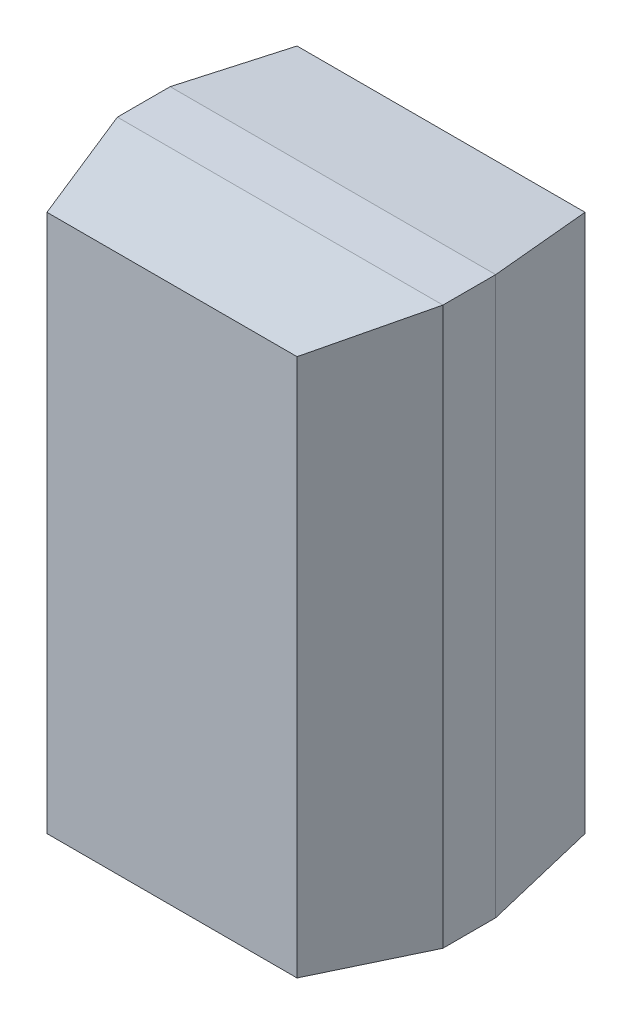
ISO-10303-21;
HEADER;
FILE_DESCRIPTION(('STEP AP214'),'2;1');
FILE_NAME('part.step','',(''),(''),'','','');
FILE_SCHEMA(('AUTOMOTIVE_DESIGN { 1 0 10303 214 1 1 1 1 }'));
ENDSEC;
DATA;
#1=APPLICATION_CONTEXT('core data for automotive mechanical design processes');
#2=APPLICATION_PROTOCOL_DEFINITION('international standard','automotive_design',2000,#1);
#3=PRODUCT_CONTEXT('',#1,'mechanical');
#4=PRODUCT('Part','Part','',(#3));
#5=PRODUCT_RELATED_PRODUCT_CATEGORY('part','',(#4));
#6=PRODUCT_DEFINITION_FORMATION('','',#4);
#7=PRODUCT_DEFINITION_CONTEXT('part definition',#1,'design');
#8=PRODUCT_DEFINITION('design','',#6,#7);
#9=PRODUCT_DEFINITION_SHAPE('','',#8);
#10=(LENGTH_UNIT() NAMED_UNIT(*) SI_UNIT(.MILLI.,.METRE.));
#11=(NAMED_UNIT(*) PLANE_ANGLE_UNIT() SI_UNIT($,.RADIAN.));
#12=(NAMED_UNIT(*) SI_UNIT($,.STERADIAN.) SOLID_ANGLE_UNIT());
#13=UNCERTAINTY_MEASURE_WITH_UNIT(LENGTH_MEASURE(1.E-05),#10,'distance_accuracy_value','');
#14=(GEOMETRIC_REPRESENTATION_CONTEXT(3) GLOBAL_UNCERTAINTY_ASSIGNED_CONTEXT((#13)) GLOBAL_UNIT_ASSIGNED_CONTEXT((#10,
#11,#12)) REPRESENTATION_CONTEXT('',''));
#15=CARTESIAN_POINT('',(0.,0.,0.));
#16=DIRECTION('',(0.,0.,1.));
#17=DIRECTION('',(1.,0.,0.));
#18=AXIS2_PLACEMENT_3D('',#15,#16,#17);
#19=CARTESIAN_POINT('',(-0.673,-1.448,1.448));
#20=DIRECTION('',(0.,0.,1.));
#21=DIRECTION('',(0.,1.,0.));
#22=AXIS2_PLACEMENT_3D('',#19,#20,#21);
#23=PLANE('',#22);
#24=CARTESIAN_POINT('',(0.673000000000001,-1.44816141898888,1.44801409985144));
#25=DIRECTION('',(-1.,0.,0.));
#26=VECTOR('',#25,1.);
#27=LINE('',#24,#26);
#28=CARTESIAN_POINT('',(0.673,-1.448,1.448));
#29=VERTEX_POINT('',#28);
#30=CARTESIAN_POINT('',(-0.673,-1.448,1.448));
#31=VERTEX_POINT('',#30);
#32=EDGE_CURVE('E11',#29,#31,#27,.T.);
#33=ORIENTED_EDGE('',*,*,#32,.F.);
#34=CARTESIAN_POINT('',(0.672595982544628,1.448,1.44785876508446));
#35=DIRECTION('',(0.,-1.,0.));
#36=VECTOR('',#35,1.);
#37=LINE('',#34,#36);
#38=CARTESIAN_POINT('',(0.673,1.448,1.448));
#39=VERTEX_POINT('',#38);
#40=EDGE_CURVE('E25',#39,#29,#37,.T.);
#41=ORIENTED_EDGE('',*,*,#40,.F.);
#42=CARTESIAN_POINT('',(-0.673000000000001,1.44816141898888,1.44801409985144));
#43=DIRECTION('',(1.,0.,0.));
#44=VECTOR('',#43,1.);
#45=LINE('',#42,#44);
#46=CARTESIAN_POINT('',(-0.673,1.448,1.448));
#47=VERTEX_POINT('',#46);
#48=EDGE_CURVE('E297',#47,#39,#45,.T.);
#49=ORIENTED_EDGE('',*,*,#48,.F.);
#50=CARTESIAN_POINT('',(-0.672595982544628,-1.448,1.44785876508446));
#51=DIRECTION('',(0.,1.,0.));
#52=VECTOR('',#51,1.);
#53=LINE('',#50,#52);
#54=EDGE_CURVE('E320',#31,#47,#53,.T.);
#55=ORIENTED_EDGE('',*,*,#54,.F.);
#56=EDGE_LOOP('',(#33,#41,#49,#55));
#57=FACE_BOUND('',#56,.T.);
#58=ADVANCED_FACE('F17',(#57),#23,.T.);
#59=CARTESIAN_POINT('',(-0.876,-1.499,0.866));
#60=DIRECTION('',(0.,-0.996206734348292,0.0870180581207845));
#61=DIRECTION('',(0.,0.0870180581207845,0.996206734348292));
#62=AXIS2_PLACEMENT_3D('',#59,#60,#61);
#63=PLANE('',#62);
#64=DIRECTION('',(-1.,0.,0.));
#65=VECTOR('',#64,1.);
#66=CARTESIAN_POINT('',(0.876,-1.499,0.866));
#67=LINE('',#66,#65);
#68=CARTESIAN_POINT('',(0.876,-1.499,0.866));
#69=VERTEX_POINT('',#68);
#70=CARTESIAN_POINT('',(-0.876,-1.499,0.866));
#71=VERTEX_POINT('',#70);
#72=EDGE_CURVE('E333',#69,#71,#67,.T.);
#73=ORIENTED_EDGE('',*,*,#72,.F.);
#74=CARTESIAN_POINT('',(0.672595982544628,-1.448,1.44785876508446));
#75=DIRECTION('',(0.328883245123108,-0.0819817202010894,-0.940805404230951));
#76=VECTOR('',#75,1.);
#77=LINE('',#74,#76);
#78=EDGE_CURVE('E340',#29,#69,#77,.T.);
#79=ORIENTED_EDGE('',*,*,#78,.F.);
#80=ORIENTED_EDGE('',*,*,#32,.T.);
#81=CARTESIAN_POINT('',(-0.876,-1.499,0.866));
#82=DIRECTION('',(0.328883245123108,0.0819817202010884,0.940805404230951));
#83=VECTOR('',#82,1.);
#84=LINE('',#81,#83);
#85=EDGE_CURVE('E241',#71,#31,#84,.T.);
#86=ORIENTED_EDGE('',*,*,#85,.F.);
#87=EDGE_LOOP('',(#73,#79,#80,#86));
#88=FACE_BOUND('',#87,.T.);
#89=ADVANCED_FACE('F246',(#88),#63,.T.);
#90=CARTESIAN_POINT('',(0.876,-1.499,0.866));
#91=DIRECTION('',(0.94398300845877,0.,0.329994060160375));
#92=DIRECTION('',(-0.329994060160375,0.,0.94398300845877));
#93=AXIS2_PLACEMENT_3D('',#90,#91,#92);
#94=PLANE('',#93);
#95=DIRECTION('',(0.,-1.,0.));
#96=VECTOR('',#95,1.);
#97=CARTESIAN_POINT('',(0.876,1.499,0.866));
#98=LINE('',#97,#96);
#99=CARTESIAN_POINT('',(0.876,1.499,0.866));
#100=VERTEX_POINT('',#99);
#101=EDGE_CURVE('E238',#100,#69,#98,.T.);
#102=ORIENTED_EDGE('',*,*,#101,.F.);
#103=CARTESIAN_POINT('',(0.673,1.44816141898888,1.44801409985144));
#104=DIRECTION('',(0.32892666378567,0.0821759789969272,-0.940773276792409));
#105=VECTOR('',#104,1.);
#106=LINE('',#103,#105);
#107=EDGE_CURVE('E234',#39,#100,#106,.T.);
#108=ORIENTED_EDGE('',*,*,#107,.F.);
#109=ORIENTED_EDGE('',*,*,#40,.T.);
#110=ORIENTED_EDGE('',*,*,#78,.T.);
#111=EDGE_LOOP('',(#102,#108,#109,#110));
#112=FACE_BOUND('',#111,.T.);
#113=ADVANCED_FACE('F211',(#112),#94,.T.);
#114=CARTESIAN_POINT('',(0.876,1.499,0.866));
#115=DIRECTION('',(0.,0.996206734348292,0.0870180581207845));
#116=DIRECTION('',(0.,-0.0870180581207845,0.996206734348292));
#117=AXIS2_PLACEMENT_3D('',#114,#115,#116);
#118=PLANE('',#117);
#119=DIRECTION('',(1.,0.,0.));
#120=VECTOR('',#119,1.);
#121=CARTESIAN_POINT('',(-0.876,1.499,0.866));
#122=LINE('',#121,#120);
#123=CARTESIAN_POINT('',(-0.876,1.499,0.866));
#124=VERTEX_POINT('',#123);
#125=EDGE_CURVE('E472',#124,#100,#122,.T.);
#126=ORIENTED_EDGE('',*,*,#125,.F.);
#127=CARTESIAN_POINT('',(-0.672595982544628,1.448,1.44785876508446));
#128=DIRECTION('',(-0.328883245123108,0.0819817202010894,-0.940805404230951));
#129=VECTOR('',#128,1.);
#130=LINE('',#127,#129);
#131=EDGE_CURVE('E193',#47,#124,#130,.T.);
#132=ORIENTED_EDGE('',*,*,#131,.F.);
#133=ORIENTED_EDGE('',*,*,#48,.T.);
#134=ORIENTED_EDGE('',*,*,#107,.T.);
#135=EDGE_LOOP('',(#126,#132,#133,#134));
#136=FACE_BOUND('',#135,.T.);
#137=ADVANCED_FACE('F200',(#136),#118,.T.);
#138=CARTESIAN_POINT('',(-0.876,1.499,0.866));
#139=DIRECTION('',(-0.94398300845877,0.,0.329994060160375));
#140=DIRECTION('',(0.329994060160375,0.,0.94398300845877));
#141=AXIS2_PLACEMENT_3D('',#138,#139,#140);
#142=PLANE('',#141);
#143=DIRECTION('',(0.,1.,0.));
#144=VECTOR('',#143,1.);
#145=CARTESIAN_POINT('',(-0.876,-1.499,0.866));
#146=LINE('',#145,#144);
#147=EDGE_CURVE('E190',#71,#124,#146,.T.);
#148=ORIENTED_EDGE('',*,*,#147,.F.);
#149=ORIENTED_EDGE('',*,*,#85,.T.);
#150=ORIENTED_EDGE('',*,*,#54,.T.);
#151=ORIENTED_EDGE('',*,*,#131,.T.);
#152=EDGE_LOOP('',(#148,#149,#150,#151));
#153=FACE_BOUND('',#152,.T.);
#154=ADVANCED_FACE('F210',(#153),#142,.T.);
#155=CARTESIAN_POINT('',(-0.876,-1.499,0.582));
#156=DIRECTION('',(0.,-1.,0.));
#157=DIRECTION('',(0.,0.,1.));
#158=AXIS2_PLACEMENT_3D('',#155,#156,#157);
#159=PLANE('',#158);
#160=CARTESIAN_POINT('',(0.876,-1.49883858101112,0.582014099851438));
#161=DIRECTION('',(-1.,0.,0.));
#162=VECTOR('',#161,1.);
#163=LINE('',#160,#162);
#164=CARTESIAN_POINT('',(0.876,-1.499,0.582));
#165=VERTEX_POINT('',#164);
#166=CARTESIAN_POINT('',(-0.876,-1.499,0.582));
#167=VERTEX_POINT('',#166);
#168=EDGE_CURVE('E186',#165,#167,#163,.T.);
#169=ORIENTED_EDGE('',*,*,#168,.F.);
#170=DIRECTION('',(0.,0.,-1.));
#171=VECTOR('',#170,1.);
#172=CARTESIAN_POINT('',(0.876,-1.499,0.866));
#173=LINE('',#172,#171);
#174=EDGE_CURVE('E367',#69,#165,#173,.T.);
#175=ORIENTED_EDGE('',*,*,#174,.F.);
#176=ORIENTED_EDGE('',*,*,#72,.T.);
#177=DIRECTION('',(0.,0.,1.));
#178=VECTOR('',#177,1.);
#179=CARTESIAN_POINT('',(-0.876,-1.499,0.582));
#180=LINE('',#179,#178);
#181=EDGE_CURVE('E364',#167,#71,#180,.T.);
#182=ORIENTED_EDGE('',*,*,#181,.F.);
#183=EDGE_LOOP('',(#169,#175,#176,#182));
#184=FACE_BOUND('',#183,.T.);
#185=ADVANCED_FACE('F381',(#184),#159,.T.);
#186=CARTESIAN_POINT('',(0.876,-1.499,0.582));
#187=DIRECTION('',(1.,0.,0.));
#188=DIRECTION('',(0.,0.,1.));
#189=AXIS2_PLACEMENT_3D('',#186,#187,#188);
#190=PLANE('',#189);
#191=CARTESIAN_POINT('',(0.876609831477812,1.499,0.581893511660727));
#192=DIRECTION('',(0.,-1.,0.));
#193=VECTOR('',#192,1.);
#194=LINE('',#191,#193);
#195=CARTESIAN_POINT('',(0.876,1.499,0.582));
#196=VERTEX_POINT('',#195);
#197=EDGE_CURVE('E368',#196,#165,#194,.T.);
#198=ORIENTED_EDGE('',*,*,#197,.F.);
#199=DIRECTION('',(0.,0.,-1.));
#200=VECTOR('',#199,1.);
#201=CARTESIAN_POINT('',(0.876,1.499,0.866));
#202=LINE('',#201,#200);
#203=EDGE_CURVE('E373',#100,#196,#202,.T.);
#204=ORIENTED_EDGE('',*,*,#203,.F.);
#205=ORIENTED_EDGE('',*,*,#101,.T.);
#206=ORIENTED_EDGE('',*,*,#174,.T.);
#207=EDGE_LOOP('',(#198,#204,#205,#206));
#208=FACE_BOUND('',#207,.T.);
#209=ADVANCED_FACE('F390',(#208),#190,.T.);
#210=CARTESIAN_POINT('',(0.876,1.499,0.582));
#211=DIRECTION('',(0.,1.,0.));
#212=DIRECTION('',(0.,0.,1.));
#213=AXIS2_PLACEMENT_3D('',#210,#211,#212);
#214=PLANE('',#213);
#215=CARTESIAN_POINT('',(-0.876,1.49883858101112,0.582014099851438));
#216=DIRECTION('',(1.,0.,0.));
#217=VECTOR('',#216,1.);
#218=LINE('',#215,#217);
#219=CARTESIAN_POINT('',(-0.876,1.499,0.582));
#220=VERTEX_POINT('',#219);
#221=EDGE_CURVE('E453',#220,#196,#218,.T.);
#222=ORIENTED_EDGE('',*,*,#221,.F.);
#223=DIRECTION('',(0.,0.,-1.));
#224=VECTOR('',#223,1.);
#225=CARTESIAN_POINT('',(-0.876,1.499,0.866));
#226=LINE('',#225,#224);
#227=EDGE_CURVE('E451',#124,#220,#226,.T.);
#228=ORIENTED_EDGE('',*,*,#227,.F.);
#229=ORIENTED_EDGE('',*,*,#125,.T.);
#230=ORIENTED_EDGE('',*,*,#203,.T.);
#231=EDGE_LOOP('',(#222,#228,#229,#230));
#232=FACE_BOUND('',#231,.T.);
#233=ADVANCED_FACE('F393',(#232),#214,.T.);
#234=CARTESIAN_POINT('',(-0.876,1.499,0.582));
#235=DIRECTION('',(-1.,0.,0.));
#236=DIRECTION('',(0.,0.,1.));
#237=AXIS2_PLACEMENT_3D('',#234,#235,#236);
#238=PLANE('',#237);
#239=CARTESIAN_POINT('',(-0.876609831477812,-1.499,0.581893511660727));
#240=DIRECTION('',(0.,1.,0.));
#241=VECTOR('',#240,1.);
#242=LINE('',#239,#241);
#243=EDGE_CURVE('E102',#167,#220,#242,.T.);
#244=ORIENTED_EDGE('',*,*,#243,.F.);
#245=ORIENTED_EDGE('',*,*,#181,.T.);
#246=ORIENTED_EDGE('',*,*,#147,.T.);
#247=ORIENTED_EDGE('',*,*,#227,.T.);
#248=EDGE_LOOP('',(#244,#245,#246,#247));
#249=FACE_BOUND('',#248,.T.);
#250=ADVANCED_FACE('F162',(#249),#238,.T.);
#251=CARTESIAN_POINT('',(-0.775,-1.448,0.));
#252=DIRECTION('',(0.,-0.996206734348292,-0.0870180581207845));
#253=DIRECTION('',(0.,-0.0870180581207845,0.996206734348292));
#254=AXIS2_PLACEMENT_3D('',#251,#252,#253);
#255=PLANE('',#254);
#256=DIRECTION('',(-1.,0.,0.));
#257=VECTOR('',#256,1.);
#258=CARTESIAN_POINT('',(0.775,-1.448,0.));
#259=LINE('',#258,#257);
#260=CARTESIAN_POINT('',(0.775,-1.448,0.));
#261=VERTEX_POINT('',#260);
#262=CARTESIAN_POINT('',(-0.775,-1.448,0.));
#263=VERTEX_POINT('',#262);
#264=EDGE_CURVE('E107',#261,#263,#259,.T.);
#265=ORIENTED_EDGE('',*,*,#264,.F.);
#266=CARTESIAN_POINT('',(0.876609831477812,-1.499,0.581893511660727));
#267=DIRECTION('',(-0.171378490593222,0.0860431222056105,-0.981440774618163));
#268=VECTOR('',#267,1.);
#269=LINE('',#266,#268);
#270=EDGE_CURVE('E419',#165,#261,#269,.T.);
#271=ORIENTED_EDGE('',*,*,#270,.F.);
#272=ORIENTED_EDGE('',*,*,#168,.T.);
#273=CARTESIAN_POINT('',(-0.775,-1.448,0.));
#274=DIRECTION('',(-0.171378490593222,-0.0860431222056098,0.981440774618163));
#275=VECTOR('',#274,1.);
#276=LINE('',#273,#275);
#277=EDGE_CURVE('E148',#263,#167,#276,.T.);
#278=ORIENTED_EDGE('',*,*,#277,.F.);
#279=EDGE_LOOP('',(#265,#271,#272,#278));
#280=FACE_BOUND('',#279,.T.);
#281=ADVANCED_FACE('F153',(#280),#255,.T.);
#282=CARTESIAN_POINT('',(0.775,-1.448,0.));
#283=DIRECTION('',(0.985094080977315,0.,-0.172016428353399));
#284=DIRECTION('',(0.172016428353399,0.,0.985094080977315));
#285=AXIS2_PLACEMENT_3D('',#282,#283,#284);
#286=PLANE('',#285);
#287=DIRECTION('',(0.,-1.,0.));
#288=VECTOR('',#287,1.);
#289=CARTESIAN_POINT('',(0.775,1.448,0.));
#290=LINE('',#289,#288);
#291=CARTESIAN_POINT('',(0.775,1.448,0.));
#292=VERTEX_POINT('',#291);
#293=EDGE_CURVE('E146',#292,#261,#290,.T.);
#294=ORIENTED_EDGE('',*,*,#293,.F.);
#295=CARTESIAN_POINT('',(0.876,1.49883858101112,0.582014099851438));
#296=DIRECTION('',(-0.171085743614868,-0.0857350763601465,-0.981518805226506));
#297=VECTOR('',#296,1.);
#298=LINE('',#295,#297);
#299=EDGE_CURVE('E88',#196,#292,#298,.T.);
#300=ORIENTED_EDGE('',*,*,#299,.F.);
#301=ORIENTED_EDGE('',*,*,#197,.T.);
#302=ORIENTED_EDGE('',*,*,#270,.T.);
#303=EDGE_LOOP('',(#294,#300,#301,#302));
#304=FACE_BOUND('',#303,.T.);
#305=ADVANCED_FACE('F125',(#304),#286,.T.);
#306=CARTESIAN_POINT('',(0.775,1.448,0.));
#307=DIRECTION('',(0.,0.996206734348292,-0.0870180581207845));
#308=DIRECTION('',(0.,0.0870180581207845,0.996206734348292));
#309=AXIS2_PLACEMENT_3D('',#306,#307,#308);
#310=PLANE('',#309);
#311=DIRECTION('',(1.,0.,0.));
#312=VECTOR('',#311,1.);
#313=CARTESIAN_POINT('',(-0.775,1.448,0.));
#314=LINE('',#313,#312);
#315=CARTESIAN_POINT('',(-0.775,1.448,0.));
#316=VERTEX_POINT('',#315);
#317=EDGE_CURVE('E81',#316,#292,#314,.T.);
#318=ORIENTED_EDGE('',*,*,#317,.F.);
#319=CARTESIAN_POINT('',(-0.876609831477812,1.499,0.581893511660727));
#320=DIRECTION('',(0.171378490593222,-0.0860431222056105,-0.981440774618163));
#321=VECTOR('',#320,1.);
#322=LINE('',#319,#321);
#323=EDGE_CURVE('E85',#220,#316,#322,.T.);
#324=ORIENTED_EDGE('',*,*,#323,.F.);
#325=ORIENTED_EDGE('',*,*,#221,.T.);
#326=ORIENTED_EDGE('',*,*,#299,.T.);
#327=EDGE_LOOP('',(#318,#324,#325,#326));
#328=FACE_BOUND('',#327,.T.);
#329=ADVANCED_FACE('F83',(#328),#310,.T.);
#330=CARTESIAN_POINT('',(-0.775,1.448,0.));
#331=DIRECTION('',(-0.985094080977315,0.,-0.172016428353399));
#332=DIRECTION('',(-0.172016428353399,0.,0.985094080977315));
#333=AXIS2_PLACEMENT_3D('',#330,#331,#332);
#334=PLANE('',#333);
#335=DIRECTION('',(0.,1.,0.));
#336=VECTOR('',#335,1.);
#337=CARTESIAN_POINT('',(-0.775,-1.448,0.));
#338=LINE('',#337,#336);
#339=EDGE_CURVE('E100',#263,#316,#338,.T.);
#340=ORIENTED_EDGE('',*,*,#339,.F.);
#341=ORIENTED_EDGE('',*,*,#277,.T.);
#342=ORIENTED_EDGE('',*,*,#243,.T.);
#343=ORIENTED_EDGE('',*,*,#323,.T.);
#344=EDGE_LOOP('',(#340,#341,#342,#343));
#345=FACE_BOUND('',#344,.T.);
#346=ADVANCED_FACE('F98',(#345),#334,.T.);
#347=CARTESIAN_POINT('',(-0.775,1.448,0.));
#348=DIRECTION('',(0.,0.,-1.));
#349=DIRECTION('',(0.,1.,0.));
#350=AXIS2_PLACEMENT_3D('',#347,#348,#349);
#351=PLANE('',#350);
#352=ORIENTED_EDGE('',*,*,#317,.T.);
#353=ORIENTED_EDGE('',*,*,#293,.T.);
#354=ORIENTED_EDGE('',*,*,#264,.T.);
#355=ORIENTED_EDGE('',*,*,#339,.T.);
#356=EDGE_LOOP('',(#352,#353,#354,#355));
#357=FACE_BOUND('',#356,.T.);
#358=ADVANCED_FACE('F106',(#357),#351,.T.);
#359=CLOSED_SHELL('',(#58,#89,#113,#137,#154,#185,#209,#233,#250,#281,#305,#329,#346,#358));
#360=MANIFOLD_SOLID_BREP('B1',#359);
#361=ADVANCED_BREP_SHAPE_REPRESENTATION('',(#18,#360),#14);
#362=SHAPE_DEFINITION_REPRESENTATION(#9,#361);
ENDSEC;
END-ISO-10303-21;
